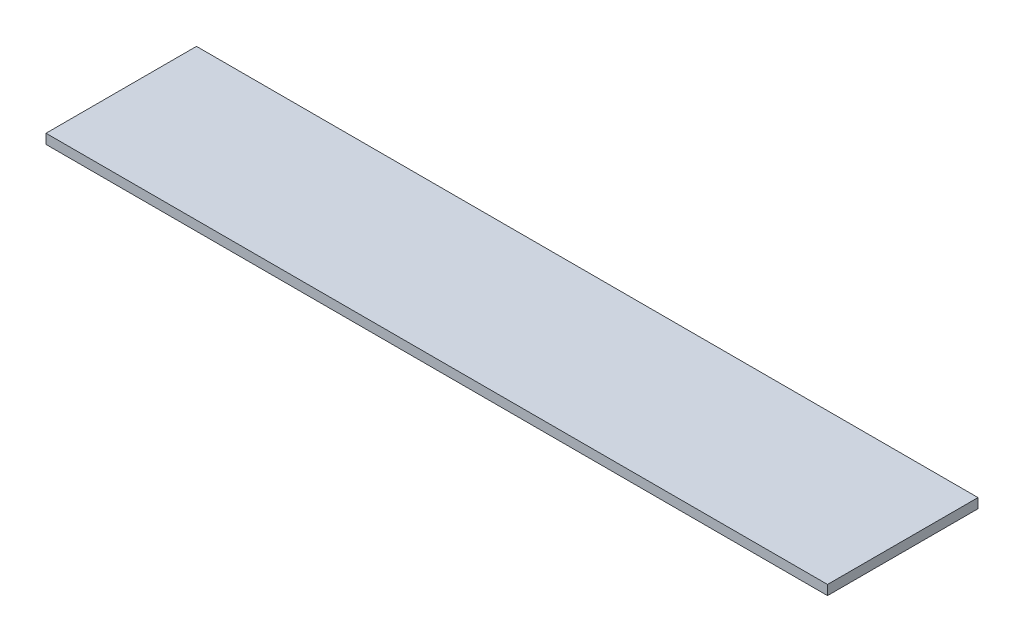
ISO-10303-21;
HEADER;
FILE_DESCRIPTION(('STEP AP214'),'2;1');
FILE_NAME('part.step','',(''),(''),'','','');
FILE_SCHEMA(('AUTOMOTIVE_DESIGN { 1 0 10303 214 1 1 1 1 }'));
ENDSEC;
DATA;
#1=APPLICATION_CONTEXT('core data for automotive mechanical design processes');
#2=APPLICATION_PROTOCOL_DEFINITION('international standard','automotive_design',2000,#1);
#3=PRODUCT_CONTEXT('',#1,'mechanical');
#4=PRODUCT('Part','Part','',(#3));
#5=PRODUCT_RELATED_PRODUCT_CATEGORY('part','',(#4));
#6=PRODUCT_DEFINITION_FORMATION('','',#4);
#7=PRODUCT_DEFINITION_CONTEXT('part definition',#1,'design');
#8=PRODUCT_DEFINITION('design','',#6,#7);
#9=PRODUCT_DEFINITION_SHAPE('','',#8);
#10=(LENGTH_UNIT() NAMED_UNIT(*) SI_UNIT(.MILLI.,.METRE.));
#11=(NAMED_UNIT(*) PLANE_ANGLE_UNIT() SI_UNIT($,.RADIAN.));
#12=(NAMED_UNIT(*) SI_UNIT($,.STERADIAN.) SOLID_ANGLE_UNIT());
#13=UNCERTAINTY_MEASURE_WITH_UNIT(LENGTH_MEASURE(1.E-05),#10,'distance_accuracy_value','');
#14=(GEOMETRIC_REPRESENTATION_CONTEXT(3) GLOBAL_UNCERTAINTY_ASSIGNED_CONTEXT((#13)) GLOBAL_UNIT_ASSIGNED_CONTEXT((#10,
#11,#12)) REPRESENTATION_CONTEXT('',''));
#15=CARTESIAN_POINT('',(0.,0.,0.));
#16=DIRECTION('',(0.,0.,1.));
#17=DIRECTION('',(1.,0.,0.));
#18=AXIS2_PLACEMENT_3D('',#15,#16,#17);
#19=CARTESIAN_POINT('',(0.,6.35,0.));
#20=DIRECTION('',(1.,0.,0.));
#21=DIRECTION('',(0.,0.,-1.));
#22=AXIS2_PLACEMENT_3D('',#19,#20,#21);
#23=PLANE('',#22);
#24=DIRECTION('',(0.,0.,1.));
#25=VECTOR('',#24,1.);
#26=CARTESIAN_POINT('',(0.,0.,0.));
#27=LINE('',#26,#25);
#28=CARTESIAN_POINT('',(0.,0.,-98.425));
#29=VERTEX_POINT('',#28);
#30=CARTESIAN_POINT('',(0.,0.,0.));
#31=VERTEX_POINT('',#30);
#32=EDGE_CURVE('E96',#29,#31,#27,.T.);
#33=ORIENTED_EDGE('',*,*,#32,.T.);
#34=DIRECTION('',(0.,-1.,0.));
#35=VECTOR('',#34,1.);
#36=CARTESIAN_POINT('',(0.,6.35,0.));
#37=LINE('',#36,#35);
#38=CARTESIAN_POINT('',(0.,6.35,0.));
#39=VERTEX_POINT('',#38);
#40=EDGE_CURVE('E11',#39,#31,#37,.T.);
#41=ORIENTED_EDGE('',*,*,#40,.F.);
#42=DIRECTION('',(0.,0.,1.));
#43=VECTOR('',#42,1.);
#44=CARTESIAN_POINT('',(0.,6.35,0.));
#45=LINE('',#44,#43);
#46=CARTESIAN_POINT('',(0.,6.35,-98.425));
#47=VERTEX_POINT('',#46);
#48=EDGE_CURVE('E84',#47,#39,#45,.T.);
#49=ORIENTED_EDGE('',*,*,#48,.F.);
#50=DIRECTION('',(0.,-1.,0.));
#51=VECTOR('',#50,1.);
#52=CARTESIAN_POINT('',(0.,6.35,-98.425));
#53=LINE('',#52,#51);
#54=EDGE_CURVE('E92',#47,#29,#53,.T.);
#55=ORIENTED_EDGE('',*,*,#54,.T.);
#56=EDGE_LOOP('',(#33,#41,#49,#55));
#57=FACE_BOUND('',#56,.T.);
#58=ADVANCED_FACE('F33',(#57),#23,.F.);
#59=CARTESIAN_POINT('',(0.,6.35,0.));
#60=DIRECTION('',(0.,0.,-1.));
#61=DIRECTION('',(-1.,0.,0.));
#62=AXIS2_PLACEMENT_3D('',#59,#60,#61);
#63=PLANE('',#62);
#64=DIRECTION('',(1.,0.,0.));
#65=VECTOR('',#64,1.);
#66=CARTESIAN_POINT('',(0.,0.,0.));
#67=LINE('',#66,#65);
#68=CARTESIAN_POINT('',(511.175,0.,0.));
#69=VERTEX_POINT('',#68);
#70=EDGE_CURVE('E88',#31,#69,#67,.T.);
#71=ORIENTED_EDGE('',*,*,#70,.T.);
#72=DIRECTION('',(0.,-1.,0.));
#73=VECTOR('',#72,1.);
#74=CARTESIAN_POINT('',(511.175,6.35,0.));
#75=LINE('',#74,#73);
#76=CARTESIAN_POINT('',(511.175,6.35,0.));
#77=VERTEX_POINT('',#76);
#78=EDGE_CURVE('E41',#77,#69,#75,.T.);
#79=ORIENTED_EDGE('',*,*,#78,.F.);
#80=DIRECTION('',(1.,0.,0.));
#81=VECTOR('',#80,1.);
#82=CARTESIAN_POINT('',(0.,6.35,0.));
#83=LINE('',#82,#81);
#84=EDGE_CURVE('E79',#39,#77,#83,.T.);
#85=ORIENTED_EDGE('',*,*,#84,.F.);
#86=ORIENTED_EDGE('',*,*,#40,.T.);
#87=EDGE_LOOP('',(#71,#79,#85,#86));
#88=FACE_BOUND('',#87,.T.);
#89=ADVANCED_FACE('F87',(#88),#63,.F.);
#90=CARTESIAN_POINT('',(511.175,6.35,0.));
#91=DIRECTION('',(-1.,0.,0.));
#92=DIRECTION('',(0.,0.,1.));
#93=AXIS2_PLACEMENT_3D('',#90,#91,#92);
#94=PLANE('',#93);
#95=DIRECTION('',(0.,0.,-1.));
#96=VECTOR('',#95,1.);
#97=CARTESIAN_POINT('',(511.175,0.,0.));
#98=LINE('',#97,#96);
#99=CARTESIAN_POINT('',(511.175,0.,-98.425));
#100=VERTEX_POINT('',#99);
#101=EDGE_CURVE('E66',#69,#100,#98,.T.);
#102=ORIENTED_EDGE('',*,*,#101,.T.);
#103=DIRECTION('',(0.,-1.,0.));
#104=VECTOR('',#103,1.);
#105=CARTESIAN_POINT('',(511.175,6.35,-98.425));
#106=LINE('',#105,#104);
#107=CARTESIAN_POINT('',(511.175,6.35,-98.425));
#108=VERTEX_POINT('',#107);
#109=EDGE_CURVE('E89',#108,#100,#106,.T.);
#110=ORIENTED_EDGE('',*,*,#109,.F.);
#111=DIRECTION('',(0.,0.,-1.));
#112=VECTOR('',#111,1.);
#113=CARTESIAN_POINT('',(511.175,6.35,0.));
#114=LINE('',#113,#112);
#115=EDGE_CURVE('E82',#77,#108,#114,.T.);
#116=ORIENTED_EDGE('',*,*,#115,.F.);
#117=ORIENTED_EDGE('',*,*,#78,.T.);
#118=EDGE_LOOP('',(#102,#110,#116,#117));
#119=FACE_BOUND('',#118,.T.);
#120=ADVANCED_FACE('F90',(#119),#94,.F.);
#121=CARTESIAN_POINT('',(0.,6.35,-98.425));
#122=DIRECTION('',(0.,0.,1.));
#123=DIRECTION('',(1.,0.,0.));
#124=AXIS2_PLACEMENT_3D('',#121,#122,#123);
#125=PLANE('',#124);
#126=DIRECTION('',(-1.,0.,0.));
#127=VECTOR('',#126,1.);
#128=CARTESIAN_POINT('',(0.,0.,-98.425));
#129=LINE('',#128,#127);
#130=EDGE_CURVE('E72',#100,#29,#129,.T.);
#131=ORIENTED_EDGE('',*,*,#130,.T.);
#132=ORIENTED_EDGE('',*,*,#54,.F.);
#133=DIRECTION('',(-1.,0.,0.));
#134=VECTOR('',#133,1.);
#135=CARTESIAN_POINT('',(0.,6.35,-98.425));
#136=LINE('',#135,#134);
#137=EDGE_CURVE('E49',#108,#47,#136,.T.);
#138=ORIENTED_EDGE('',*,*,#137,.F.);
#139=ORIENTED_EDGE('',*,*,#109,.T.);
#140=EDGE_LOOP('',(#131,#132,#138,#139));
#141=FACE_BOUND('',#140,.T.);
#142=ADVANCED_FACE('F103',(#141),#125,.F.);
#143=CARTESIAN_POINT('',(0.,6.35,0.));
#144=DIRECTION('',(0.,-1.,0.));
#145=DIRECTION('',(0.,0.,-1.));
#146=AXIS2_PLACEMENT_3D('',#143,#144,#145);
#147=PLANE('',#146);
#148=ORIENTED_EDGE('',*,*,#48,.T.);
#149=ORIENTED_EDGE('',*,*,#84,.T.);
#150=ORIENTED_EDGE('',*,*,#115,.T.);
#151=ORIENTED_EDGE('',*,*,#137,.T.);
#152=EDGE_LOOP('',(#148,#149,#150,#151));
#153=FACE_BOUND('',#152,.T.);
#154=ADVANCED_FACE('F80',(#153),#147,.F.);
#155=CARTESIAN_POINT('',(0.,0.,0.));
#156=DIRECTION('',(0.,-1.,0.));
#157=DIRECTION('',(0.,0.,-1.));
#158=AXIS2_PLACEMENT_3D('',#155,#156,#157);
#159=PLANE('',#158);
#160=ORIENTED_EDGE('',*,*,#32,.F.);
#161=ORIENTED_EDGE('',*,*,#130,.F.);
#162=ORIENTED_EDGE('',*,*,#101,.F.);
#163=ORIENTED_EDGE('',*,*,#70,.F.);
#164=EDGE_LOOP('',(#160,#161,#162,#163));
#165=FACE_BOUND('',#164,.T.);
#166=ADVANCED_FACE('F106',(#165),#159,.T.);
#167=CLOSED_SHELL('',(#58,#89,#120,#142,#154,#166));
#168=MANIFOLD_SOLID_BREP('B2',#167);
#169=ADVANCED_BREP_SHAPE_REPRESENTATION('',(#18,#168),#14);
#170=SHAPE_DEFINITION_REPRESENTATION(#9,#169);
ENDSEC;
END-ISO-10303-21;
